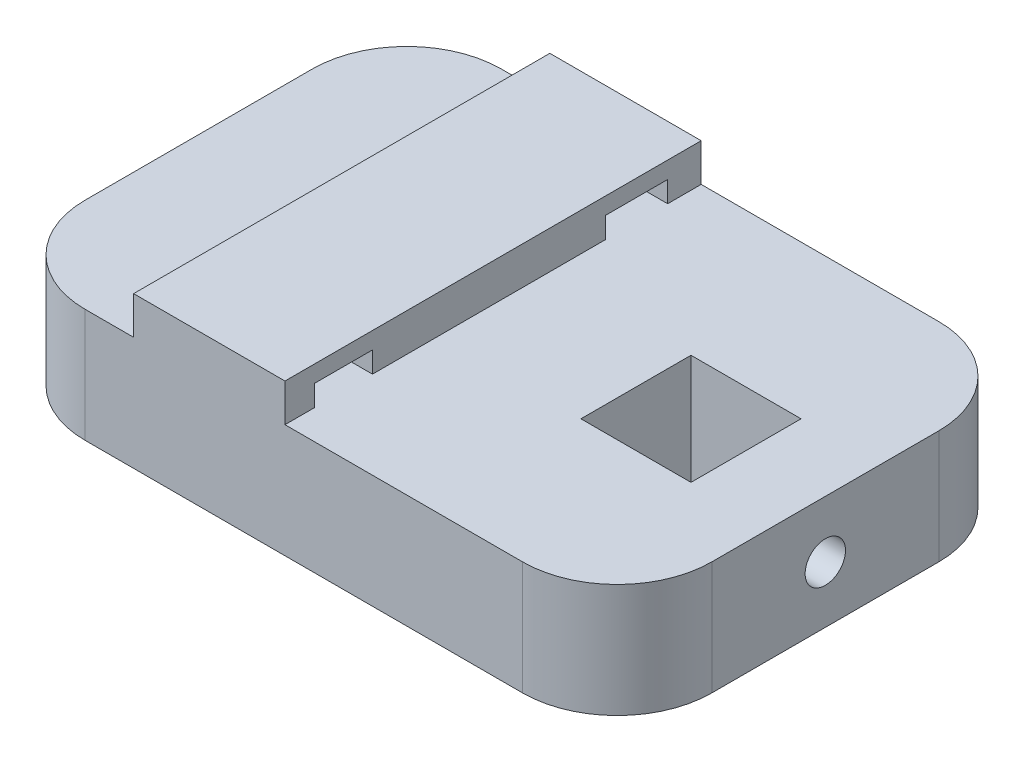
ISO-10303-21;
HEADER;
FILE_DESCRIPTION(('STEP AP214'),'2;1');
FILE_NAME('part.step','',(''),(''),'','','');
FILE_SCHEMA(('AUTOMOTIVE_DESIGN { 1 0 10303 214 1 1 1 1 }'));
ENDSEC;
DATA;
#1=APPLICATION_CONTEXT('core data for automotive mechanical design processes');
#2=APPLICATION_PROTOCOL_DEFINITION('international standard','automotive_design',2000,#1);
#3=PRODUCT_CONTEXT('',#1,'mechanical');
#4=PRODUCT('Part','Part','',(#3));
#5=PRODUCT_RELATED_PRODUCT_CATEGORY('part','',(#4));
#6=PRODUCT_DEFINITION_FORMATION('','',#4);
#7=PRODUCT_DEFINITION_CONTEXT('part definition',#1,'design');
#8=PRODUCT_DEFINITION('design','',#6,#7);
#9=PRODUCT_DEFINITION_SHAPE('','',#8);
#10=(LENGTH_UNIT() NAMED_UNIT(*) SI_UNIT(.MILLI.,.METRE.));
#11=(NAMED_UNIT(*) PLANE_ANGLE_UNIT() SI_UNIT($,.RADIAN.));
#12=(NAMED_UNIT(*) SI_UNIT($,.STERADIAN.) SOLID_ANGLE_UNIT());
#13=UNCERTAINTY_MEASURE_WITH_UNIT(LENGTH_MEASURE(1.E-05),#10,'distance_accuracy_value','');
#14=(GEOMETRIC_REPRESENTATION_CONTEXT(3) GLOBAL_UNCERTAINTY_ASSIGNED_CONTEXT((#13)) GLOBAL_UNIT_ASSIGNED_CONTEXT((#10,
#11,#12)) REPRESENTATION_CONTEXT('',''));
#15=CARTESIAN_POINT('',(0.,0.,0.));
#16=DIRECTION('',(0.,0.,1.));
#17=DIRECTION('',(1.,0.,0.));
#18=AXIS2_PLACEMENT_3D('',#15,#16,#17);
#19=CARTESIAN_POINT('',(41.400095641022,-10.0000000000002,55.));
#20=DIRECTION('',(-1.,0.,0.));
#21=DIRECTION('',(0.,0.,1.));
#22=AXIS2_PLACEMENT_3D('',#19,#20,#21);
#23=PLANE('',#22);
#24=CARTESIAN_POINT('',(41.400095641022,-2.51639275853466,27.5));
#25=DIRECTION('',(1.,0.,0.));
#26=DIRECTION('',(0.,0.,-1.));
#27=AXIS2_PLACEMENT_3D('',#24,#25,#26);
#28=CIRCLE('',#27,2.66597218164758);
#29=CARTESIAN_POINT('',(41.400095641022,-2.51639275853466,24.8340278183524));
#30=VERTEX_POINT('',#29);
#31=EDGE_CURVE('E257',#30,#30,#28,.T.);
#32=ORIENTED_EDGE('',*,*,#31,.F.);
#33=EDGE_LOOP('',(#32));
#34=FACE_BOUND('',#33,.T.);
#35=DIRECTION('',(0.,0.,-1.));
#36=VECTOR('',#35,1.);
#37=CARTESIAN_POINT('',(41.400095641022,-10.0000000000002,55.));
#38=LINE('',#37,#36);
#39=CARTESIAN_POINT('',(41.400095641022,-10.0000000000002,42.5));
#40=VERTEX_POINT('',#39);
#41=CARTESIAN_POINT('',(41.400095641022,-10.0000000000002,12.5));
#42=VERTEX_POINT('',#41);
#43=EDGE_CURVE('E289',#40,#42,#38,.T.);
#44=ORIENTED_EDGE('',*,*,#43,.T.);
#45=DIRECTION('',(0.,1.,0.));
#46=VECTOR('',#45,1.);
#47=CARTESIAN_POINT('',(41.400095641022,-10.0000000000002,12.5));
#48=LINE('',#47,#46);
#49=CARTESIAN_POINT('',(41.400095641022,5.00000000000021,12.5));
#50=VERTEX_POINT('',#49);
#51=EDGE_CURVE('E11',#42,#50,#48,.T.);
#52=ORIENTED_EDGE('',*,*,#51,.T.);
#53=DIRECTION('',(0.,0.,-1.));
#54=VECTOR('',#53,1.);
#55=CARTESIAN_POINT('',(41.400095641022,5.00000000000021,55.));
#56=LINE('',#55,#54);
#57=CARTESIAN_POINT('',(41.400095641022,5.00000000000021,42.5));
#58=VERTEX_POINT('',#57);
#59=EDGE_CURVE('E228',#58,#50,#56,.T.);
#60=ORIENTED_EDGE('',*,*,#59,.F.);
#61=DIRECTION('',(0.,1.,0.));
#62=VECTOR('',#61,1.);
#63=CARTESIAN_POINT('',(41.400095641022,-10.0000000000002,42.5));
#64=LINE('',#63,#62);
#65=EDGE_CURVE('E42',#58,#40,#64,.F.);
#66=ORIENTED_EDGE('',*,*,#65,.T.);
#67=EDGE_LOOP('',(#44,#52,#60,#66));
#68=FACE_BOUND('',#67,.T.);
#69=ADVANCED_FACE('F34',(#34,#68),#23,.F.);
#70=CARTESIAN_POINT('',(-2.49990516364096,5.00000000000021,55.));
#71=DIRECTION('',(-1.,0.,0.));
#72=DIRECTION('',(0.,0.,1.));
#73=AXIS2_PLACEMENT_3D('',#70,#71,#72);
#74=PLANE('',#73);
#75=DIRECTION('',(0.,0.,-1.));
#76=VECTOR('',#75,1.);
#77=CARTESIAN_POINT('',(-2.49990516364096,5.00000000000021,55.));
#78=LINE('',#77,#76);
#79=CARTESIAN_POINT('',(-2.49990516364096,5.00000000000021,55.));
#80=VERTEX_POINT('',#79);
#81=CARTESIAN_POINT('',(-2.49990516364096,5.00000000000021,51.1092158490829));
#82=VERTEX_POINT('',#81);
#83=EDGE_CURVE('E225',#80,#82,#78,.T.);
#84=ORIENTED_EDGE('',*,*,#83,.T.);
#85=DIRECTION('',(0.,-1.,0.));
#86=VECTOR('',#85,1.);
#87=CARTESIAN_POINT('',(-2.49990516364096,7.77710730648635,51.1092158490829));
#88=LINE('',#87,#86);
#89=CARTESIAN_POINT('',(-2.49990516364096,7.77710730648635,51.1092158490829));
#90=VERTEX_POINT('',#89);
#91=EDGE_CURVE('E220',#90,#82,#88,.T.);
#92=ORIENTED_EDGE('',*,*,#91,.F.);
#93=DIRECTION('',(0.,0.,1.));
#94=VECTOR('',#93,1.);
#95=CARTESIAN_POINT('',(-2.49990516364096,7.77710730648635,51.1092158490829));
#96=LINE('',#95,#94);
#97=CARTESIAN_POINT('',(-2.49990516364096,7.77710730648635,43.4359727984542));
#98=VERTEX_POINT('',#97);
#99=EDGE_CURVE('E219',#98,#90,#96,.T.);
#100=ORIENTED_EDGE('',*,*,#99,.F.);
#101=DIRECTION('',(0.,1.,0.));
#102=VECTOR('',#101,1.);
#103=CARTESIAN_POINT('',(-2.49990516364096,7.77710730648635,43.4359727984542));
#104=LINE('',#103,#102);
#105=CARTESIAN_POINT('',(-2.49990516364096,5.00000000000021,43.4359727984542));
#106=VERTEX_POINT('',#105);
#107=EDGE_CURVE('E200',#106,#98,#104,.T.);
#108=ORIENTED_EDGE('',*,*,#107,.F.);
#109=CARTESIAN_POINT('',(-2.49990516364096,5.00000000000021,12.6151132117625));
#110=VERTEX_POINT('',#109);
#111=EDGE_CURVE('E216',#106,#110,#78,.T.);
#112=ORIENTED_EDGE('',*,*,#111,.T.);
#113=DIRECTION('',(0.,-1.,0.));
#114=VECTOR('',#113,1.);
#115=CARTESIAN_POINT('',(-2.49990516364096,7.77710730648635,12.6151132117625));
#116=LINE('',#115,#114);
#117=CARTESIAN_POINT('',(-2.49990516364096,7.77710730648635,12.6151132117625));
#118=VERTEX_POINT('',#117);
#119=EDGE_CURVE('E256',#118,#110,#116,.T.);
#120=ORIENTED_EDGE('',*,*,#119,.F.);
#121=DIRECTION('',(0.,0.,1.));
#122=VECTOR('',#121,1.);
#123=CARTESIAN_POINT('',(-2.49990516364096,7.77710730648635,12.6151132117625));
#124=LINE('',#123,#122);
#125=CARTESIAN_POINT('',(-2.49990516364096,7.77710730648635,4.43032062442529));
#126=VERTEX_POINT('',#125);
#127=EDGE_CURVE('E478',#126,#118,#124,.T.);
#128=ORIENTED_EDGE('',*,*,#127,.F.);
#129=DIRECTION('',(0.,1.,0.));
#130=VECTOR('',#129,1.);
#131=CARTESIAN_POINT('',(-2.49990516364096,7.77710730648635,4.43032062442529));
#132=LINE('',#131,#130);
#133=CARTESIAN_POINT('',(-2.49990516364096,5.00000000000021,4.43032062442529));
#134=VERTEX_POINT('',#133);
#135=EDGE_CURVE('E475',#134,#126,#132,.T.);
#136=ORIENTED_EDGE('',*,*,#135,.F.);
#137=CARTESIAN_POINT('',(-2.49990516364096,5.00000000000021,0.));
#138=VERTEX_POINT('',#137);
#139=EDGE_CURVE('E226',#134,#138,#78,.T.);
#140=ORIENTED_EDGE('',*,*,#139,.T.);
#141=DIRECTION('',(0.,1.,0.));
#142=VECTOR('',#141,1.);
#143=CARTESIAN_POINT('',(-2.49990516364096,5.00000000000021,0.));
#144=LINE('',#143,#142);
#145=CARTESIAN_POINT('',(-2.49990516364096,10.0000000000002,0.));
#146=VERTEX_POINT('',#145);
#147=EDGE_CURVE('E331',#138,#146,#144,.T.);
#148=ORIENTED_EDGE('',*,*,#147,.T.);
#149=DIRECTION('',(0.,0.,-1.));
#150=VECTOR('',#149,1.);
#151=CARTESIAN_POINT('',(-2.49990516364096,10.0000000000002,55.));
#152=LINE('',#151,#150);
#153=CARTESIAN_POINT('',(-2.49990516364096,10.0000000000002,55.));
#154=VERTEX_POINT('',#153);
#155=EDGE_CURVE('E230',#154,#146,#152,.T.);
#156=ORIENTED_EDGE('',*,*,#155,.F.);
#157=DIRECTION('',(0.,1.,0.));
#158=VECTOR('',#157,1.);
#159=CARTESIAN_POINT('',(-2.49990516364096,5.00000000000021,55.));
#160=LINE('',#159,#158);
#161=EDGE_CURVE('E312',#80,#154,#160,.T.);
#162=ORIENTED_EDGE('',*,*,#161,.F.);
#163=EDGE_LOOP('',(#84,#92,#100,#108,#112,#120,#128,#136,#140,#148,#156,#162));
#164=FACE_BOUND('',#163,.T.);
#165=ADVANCED_FACE('F214',(#164),#74,.F.);
#166=CARTESIAN_POINT('',(-2.49990516364096,10.0000000000002,55.));
#167=DIRECTION('',(0.,-1.,0.));
#168=DIRECTION('',(0.,0.,-1.));
#169=AXIS2_PLACEMENT_3D('',#166,#167,#168);
#170=PLANE('',#169);
#171=DIRECTION('',(-1.,0.,0.));
#172=VECTOR('',#171,1.);
#173=CARTESIAN_POINT('',(-2.49990516364096,10.0000000000002,0.));
#174=LINE('',#173,#172);
#175=CARTESIAN_POINT('',(-22.499903554315,10.0000000000002,0.));
#176=VERTEX_POINT('',#175);
#177=EDGE_CURVE('E334',#146,#176,#174,.T.);
#178=ORIENTED_EDGE('',*,*,#177,.T.);
#179=DIRECTION('',(0.,0.,-1.));
#180=VECTOR('',#179,1.);
#181=CARTESIAN_POINT('',(-22.499903554315,10.0000000000002,55.));
#182=LINE('',#181,#180);
#183=CARTESIAN_POINT('',(-22.499903554315,10.0000000000002,55.));
#184=VERTEX_POINT('',#183);
#185=EDGE_CURVE('E347',#184,#176,#182,.T.);
#186=ORIENTED_EDGE('',*,*,#185,.F.);
#187=DIRECTION('',(-1.,0.,0.));
#188=VECTOR('',#187,1.);
#189=CARTESIAN_POINT('',(-2.49990516364096,10.0000000000002,55.));
#190=LINE('',#189,#188);
#191=EDGE_CURVE('E315',#154,#184,#190,.T.);
#192=ORIENTED_EDGE('',*,*,#191,.F.);
#193=ORIENTED_EDGE('',*,*,#155,.T.);
#194=EDGE_LOOP('',(#178,#186,#192,#193));
#195=FACE_BOUND('',#194,.T.);
#196=ADVANCED_FACE('F359',(#195),#170,.F.);
#197=CARTESIAN_POINT('',(-22.499903554315,10.0000000000002,55.));
#198=DIRECTION('',(1.,0.,0.));
#199=DIRECTION('',(0.,0.,-1.));
#200=AXIS2_PLACEMENT_3D('',#197,#198,#199);
#201=PLANE('',#200);
#202=DIRECTION('',(0.,0.,1.));
#203=VECTOR('',#202,1.);
#204=CARTESIAN_POINT('',(-22.499903554315,7.77710730648635,55.));
#205=LINE('',#204,#203);
#206=CARTESIAN_POINT('',(-22.499903554315,7.77710730648635,43.4359727984542));
#207=VERTEX_POINT('',#206);
#208=CARTESIAN_POINT('',(-22.499903554315,7.77710730648635,51.1092158490829));
#209=VERTEX_POINT('',#208);
#210=EDGE_CURVE('E249',#207,#209,#205,.T.);
#211=ORIENTED_EDGE('',*,*,#210,.T.);
#212=DIRECTION('',(0.,-1.,0.));
#213=VECTOR('',#212,1.);
#214=CARTESIAN_POINT('',(-22.499903554315,10.0000000000002,51.1092158490829));
#215=LINE('',#214,#213);
#216=CARTESIAN_POINT('',(-22.499903554315,5.00000000000021,51.1092158490829));
#217=VERTEX_POINT('',#216);
#218=EDGE_CURVE('E376',#209,#217,#215,.T.);
#219=ORIENTED_EDGE('',*,*,#218,.T.);
#220=DIRECTION('',(0.,0.,-1.));
#221=VECTOR('',#220,1.);
#222=CARTESIAN_POINT('',(-22.499903554315,5.00000000000021,55.));
#223=LINE('',#222,#221);
#224=CARTESIAN_POINT('',(-22.499903554315,5.00000000000021,55.));
#225=VERTEX_POINT('',#224);
#226=EDGE_CURVE('E345',#225,#217,#223,.T.);
#227=ORIENTED_EDGE('',*,*,#226,.F.);
#228=DIRECTION('',(0.,-1.,0.));
#229=VECTOR('',#228,1.);
#230=CARTESIAN_POINT('',(-22.499903554315,10.0000000000002,55.));
#231=LINE('',#230,#229);
#232=EDGE_CURVE('E324',#184,#225,#231,.T.);
#233=ORIENTED_EDGE('',*,*,#232,.F.);
#234=ORIENTED_EDGE('',*,*,#185,.T.);
#235=DIRECTION('',(0.,-1.,0.));
#236=VECTOR('',#235,1.);
#237=CARTESIAN_POINT('',(-22.499903554315,10.0000000000002,0.));
#238=LINE('',#237,#236);
#239=CARTESIAN_POINT('',(-22.499903554315,5.00000000000021,0.));
#240=VERTEX_POINT('',#239);
#241=EDGE_CURVE('E336',#176,#240,#238,.T.);
#242=ORIENTED_EDGE('',*,*,#241,.T.);
#243=CARTESIAN_POINT('',(-22.499903554315,5.00000000000021,4.43032062442529));
#244=VERTEX_POINT('',#243);
#245=EDGE_CURVE('E344',#244,#240,#223,.T.);
#246=ORIENTED_EDGE('',*,*,#245,.F.);
#247=DIRECTION('',(0.,1.,0.));
#248=VECTOR('',#247,1.);
#249=CARTESIAN_POINT('',(-22.499903554315,10.0000000000002,4.43032062442529));
#250=LINE('',#249,#248);
#251=CARTESIAN_POINT('',(-22.499903554315,7.77710730648635,4.43032062442529));
#252=VERTEX_POINT('',#251);
#253=EDGE_CURVE('E370',#244,#252,#250,.T.);
#254=ORIENTED_EDGE('',*,*,#253,.T.);
#255=DIRECTION('',(0.,0.,1.));
#256=VECTOR('',#255,1.);
#257=CARTESIAN_POINT('',(-22.499903554315,7.77710730648635,55.));
#258=LINE('',#257,#256);
#259=CARTESIAN_POINT('',(-22.499903554315,7.77710730648635,12.6151132117625));
#260=VERTEX_POINT('',#259);
#261=EDGE_CURVE('E246',#252,#260,#258,.T.);
#262=ORIENTED_EDGE('',*,*,#261,.T.);
#263=DIRECTION('',(0.,-1.,0.));
#264=VECTOR('',#263,1.);
#265=CARTESIAN_POINT('',(-22.499903554315,10.0000000000002,12.6151132117625));
#266=LINE('',#265,#264);
#267=CARTESIAN_POINT('',(-22.499903554315,5.00000000000021,12.6151132117625));
#268=VERTEX_POINT('',#267);
#269=EDGE_CURVE('E372',#260,#268,#266,.T.);
#270=ORIENTED_EDGE('',*,*,#269,.T.);
#271=CARTESIAN_POINT('',(-22.499903554315,5.00000000000021,43.4359727984542));
#272=VERTEX_POINT('',#271);
#273=EDGE_CURVE('E348',#272,#268,#223,.T.);
#274=ORIENTED_EDGE('',*,*,#273,.F.);
#275=DIRECTION('',(0.,1.,0.));
#276=VECTOR('',#275,1.);
#277=CARTESIAN_POINT('',(-22.499903554315,10.0000000000002,43.4359727984542));
#278=LINE('',#277,#276);
#279=EDGE_CURVE('E203',#272,#207,#278,.T.);
#280=ORIENTED_EDGE('',*,*,#279,.T.);
#281=EDGE_LOOP('',(#211,#219,#227,#233,#234,#242,#246,#254,#262,#270,#274,#280));
#282=FACE_BOUND('',#281,.T.);
#283=ADVANCED_FACE('F367',(#282),#201,.F.);
#284=CARTESIAN_POINT('',(-28.9000956410219,5.00000000000021,55.));
#285=DIRECTION('',(0.,-1.,0.));
#286=DIRECTION('',(0.,0.,-1.));
#287=AXIS2_PLACEMENT_3D('',#284,#285,#286);
#288=PLANE('',#287);
#289=ORIENTED_EDGE('',*,*,#111,.F.);
#290=DIRECTION('',(1.,0.,0.));
#291=VECTOR('',#290,1.);
#292=CARTESIAN_POINT('',(-57.499905163641,5.00000000000021,43.4359727984542));
#293=LINE('',#292,#291);
#294=EDGE_CURVE('E196',#272,#106,#293,.T.);
#295=ORIENTED_EDGE('',*,*,#294,.F.);
#296=ORIENTED_EDGE('',*,*,#273,.T.);
#297=DIRECTION('',(1.,0.,0.));
#298=VECTOR('',#297,1.);
#299=CARTESIAN_POINT('',(-57.499905163641,5.00000000000021,12.6151132117625));
#300=LINE('',#299,#298);
#301=EDGE_CURVE('E224',#268,#110,#300,.T.);
#302=ORIENTED_EDGE('',*,*,#301,.T.);
#303=EDGE_LOOP('',(#289,#295,#296,#302));
#304=FACE_BOUND('',#303,.T.);
#305=DIRECTION('',(-1.,0.,0.));
#306=VECTOR('',#305,1.);
#307=CARTESIAN_POINT('',(-28.9000956410219,5.00000000000021,0.));
#308=LINE('',#307,#306);
#309=CARTESIAN_POINT('',(-28.9000956410221,5.00000000000021,0.));
#310=VERTEX_POINT('',#309);
#311=EDGE_CURVE('E317',#240,#310,#308,.T.);
#312=ORIENTED_EDGE('',*,*,#311,.T.);
#313=CARTESIAN_POINT('',(-28.9000956410221,5.00000000000021,12.5));
#314=DIRECTION('',(0.,-1.,0.));
#315=DIRECTION('',(0.,0.,-1.));
#316=AXIS2_PLACEMENT_3D('',#313,#314,#315);
#317=CIRCLE('',#316,12.5);
#318=CARTESIAN_POINT('',(-41.4000956410221,5.00000000000021,12.5));
#319=VERTEX_POINT('',#318);
#320=EDGE_CURVE('E278',#310,#319,#317,.F.);
#321=ORIENTED_EDGE('',*,*,#320,.T.);
#322=DIRECTION('',(0.,0.,-1.));
#323=VECTOR('',#322,1.);
#324=CARTESIAN_POINT('',(-41.4000956410221,5.00000000000021,55.));
#325=LINE('',#324,#323);
#326=CARTESIAN_POINT('',(-41.4000956410221,5.00000000000021,42.5));
#327=VERTEX_POINT('',#326);
#328=EDGE_CURVE('E341',#327,#319,#325,.T.);
#329=ORIENTED_EDGE('',*,*,#328,.F.);
#330=CARTESIAN_POINT('',(-28.9000956410221,5.00000000000021,42.5));
#331=DIRECTION('',(0.,-1.,0.));
#332=DIRECTION('',(0.,0.,-1.));
#333=AXIS2_PLACEMENT_3D('',#330,#331,#332);
#334=CIRCLE('',#333,12.5);
#335=CARTESIAN_POINT('',(-28.9000956410221,5.00000000000021,55.));
#336=VERTEX_POINT('',#335);
#337=EDGE_CURVE('E276',#327,#336,#334,.F.);
#338=ORIENTED_EDGE('',*,*,#337,.T.);
#339=DIRECTION('',(-1.,0.,0.));
#340=VECTOR('',#339,1.);
#341=CARTESIAN_POINT('',(-22.499903554315,5.00000000000021,55.));
#342=LINE('',#341,#340);
#343=EDGE_CURVE('E326',#225,#336,#342,.T.);
#344=ORIENTED_EDGE('',*,*,#343,.F.);
#345=ORIENTED_EDGE('',*,*,#226,.T.);
#346=DIRECTION('',(1.,0.,0.));
#347=VECTOR('',#346,1.);
#348=CARTESIAN_POINT('',(-57.499905163641,5.00000000000021,51.1092158490829));
#349=LINE('',#348,#347);
#350=EDGE_CURVE('E209',#217,#82,#349,.T.);
#351=ORIENTED_EDGE('',*,*,#350,.T.);
#352=ORIENTED_EDGE('',*,*,#83,.F.);
#353=DIRECTION('',(-1.,0.,0.));
#354=VECTOR('',#353,1.);
#355=CARTESIAN_POINT('',(41.400095641022,5.00000000000021,55.));
#356=LINE('',#355,#354);
#357=CARTESIAN_POINT('',(28.900095641022,5.00000000000021,55.));
#358=VERTEX_POINT('',#357);
#359=EDGE_CURVE('E306',#358,#80,#356,.T.);
#360=ORIENTED_EDGE('',*,*,#359,.F.);
#361=CARTESIAN_POINT('',(28.900095641022,5.00000000000021,42.5));
#362=DIRECTION('',(0.,-1.,0.));
#363=DIRECTION('',(0.,0.,-1.));
#364=AXIS2_PLACEMENT_3D('',#361,#362,#363);
#365=CIRCLE('',#364,12.5);
#366=EDGE_CURVE('E56',#358,#58,#365,.F.);
#367=ORIENTED_EDGE('',*,*,#366,.T.);
#368=ORIENTED_EDGE('',*,*,#59,.T.);
#369=CARTESIAN_POINT('',(28.900095641022,5.00000000000021,12.5));
#370=DIRECTION('',(0.,-1.,0.));
#371=DIRECTION('',(0.,0.,-1.));
#372=AXIS2_PLACEMENT_3D('',#369,#370,#371);
#373=CIRCLE('',#372,12.5);
#374=CARTESIAN_POINT('',(28.900095641022,5.00000000000021,0.));
#375=VERTEX_POINT('',#374);
#376=EDGE_CURVE('E49',#50,#375,#373,.F.);
#377=ORIENTED_EDGE('',*,*,#376,.T.);
#378=DIRECTION('',(-1.,0.,0.));
#379=VECTOR('',#378,1.);
#380=CARTESIAN_POINT('',(28.900095641022,5.00000000000021,0.));
#381=LINE('',#380,#379);
#382=EDGE_CURVE('E329',#375,#138,#381,.T.);
#383=ORIENTED_EDGE('',*,*,#382,.T.);
#384=ORIENTED_EDGE('',*,*,#139,.F.);
#385=DIRECTION('',(1.,0.,0.));
#386=VECTOR('',#385,1.);
#387=CARTESIAN_POINT('',(-57.499905163641,5.00000000000021,4.43032062442529));
#388=LINE('',#387,#386);
#389=EDGE_CURVE('E485',#244,#134,#388,.T.);
#390=ORIENTED_EDGE('',*,*,#389,.F.);
#391=ORIENTED_EDGE('',*,*,#245,.T.);
#392=EDGE_LOOP('',(#312,#321,#329,#338,#344,#345,#351,#352,#360,#367,#368,#377,#383,#384,#390,#391));
#393=FACE_BOUND('',#392,.T.);
#394=DIRECTION('',(0.,0.,1.));
#395=VECTOR('',#394,1.);
#396=CARTESIAN_POINT('',(16.3790224203838,5.00000000000021,0.));
#397=LINE('',#396,#395);
#398=CARTESIAN_POINT('',(16.3790224203838,5.00000000000021,20.2274188307999));
#399=VERTEX_POINT('',#398);
#400=CARTESIAN_POINT('',(16.3790224203838,5.00000000000021,34.7725811692001));
#401=VERTEX_POINT('',#400);
#402=EDGE_CURVE('E386',#399,#401,#397,.T.);
#403=ORIENTED_EDGE('',*,*,#402,.F.);
#404=DIRECTION('',(-1.,0.,0.));
#405=VECTOR('',#404,1.);
#406=CARTESIAN_POINT('',(0.,5.00000000000021,20.2274188307999));
#407=LINE('',#406,#405);
#408=CARTESIAN_POINT('',(30.924184758784,5.00000000000021,20.2274188307999));
#409=VERTEX_POINT('',#408);
#410=EDGE_CURVE('E384',#409,#399,#407,.T.);
#411=ORIENTED_EDGE('',*,*,#410,.F.);
#412=DIRECTION('',(0.,0.,1.));
#413=VECTOR('',#412,1.);
#414=CARTESIAN_POINT('',(30.924184758784,5.00000000000021,0.));
#415=LINE('',#414,#413);
#416=CARTESIAN_POINT('',(30.924184758784,5.00000000000021,34.7725811692001));
#417=VERTEX_POINT('',#416);
#418=EDGE_CURVE('E392',#409,#417,#415,.T.);
#419=ORIENTED_EDGE('',*,*,#418,.T.);
#420=DIRECTION('',(-1.,0.,0.));
#421=VECTOR('',#420,1.);
#422=CARTESIAN_POINT('',(0.,5.00000000000021,34.7725811692001));
#423=LINE('',#422,#421);
#424=EDGE_CURVE('E389',#417,#401,#423,.T.);
#425=ORIENTED_EDGE('',*,*,#424,.T.);
#426=EDGE_LOOP('',(#403,#411,#419,#425));
#427=FACE_BOUND('',#426,.T.);
#428=ADVANCED_FACE('F223',(#304,#393,#427),#288,.F.);
#429=CARTESIAN_POINT('',(-41.4000956410221,5.00000000000021,55.));
#430=DIRECTION('',(1.,0.,0.));
#431=DIRECTION('',(0.,0.,-1.));
#432=AXIS2_PLACEMENT_3D('',#429,#430,#431);
#433=PLANE('',#432);
#434=ORIENTED_EDGE('',*,*,#328,.T.);
#435=DIRECTION('',(0.,-1.,0.));
#436=VECTOR('',#435,1.);
#437=CARTESIAN_POINT('',(-41.4000956410221,5.00000000000021,12.5));
#438=LINE('',#437,#436);
#439=CARTESIAN_POINT('',(-41.4000956410221,-10.0000000000002,12.5));
#440=VERTEX_POINT('',#439);
#441=EDGE_CURVE('E259',#319,#440,#438,.T.);
#442=ORIENTED_EDGE('',*,*,#441,.T.);
#443=DIRECTION('',(0.,0.,-1.));
#444=VECTOR('',#443,1.);
#445=CARTESIAN_POINT('',(-41.4000956410221,-10.0000000000002,55.));
#446=LINE('',#445,#444);
#447=CARTESIAN_POINT('',(-41.4000956410221,-10.0000000000002,42.5));
#448=VERTEX_POINT('',#447);
#449=EDGE_CURVE('E299',#448,#440,#446,.T.);
#450=ORIENTED_EDGE('',*,*,#449,.F.);
#451=DIRECTION('',(0.,-1.,0.));
#452=VECTOR('',#451,1.);
#453=CARTESIAN_POINT('',(-41.4000956410221,5.00000000000021,42.5));
#454=LINE('',#453,#452);
#455=EDGE_CURVE('E252',#448,#327,#454,.F.);
#456=ORIENTED_EDGE('',*,*,#455,.T.);
#457=EDGE_LOOP('',(#434,#442,#450,#456));
#458=FACE_BOUND('',#457,.T.);
#459=ADVANCED_FACE('F457',(#458),#433,.F.);
#460=CARTESIAN_POINT('',(28.900095641022,-10.0000000000002,55.));
#461=DIRECTION('',(0.,1.,0.));
#462=DIRECTION('',(0.,0.,1.));
#463=AXIS2_PLACEMENT_3D('',#460,#461,#462);
#464=PLANE('',#463);
#465=DIRECTION('',(0.,0.,1.));
#466=VECTOR('',#465,1.);
#467=CARTESIAN_POINT('',(30.924184758784,-10.0000000000002,55.));
#468=LINE('',#467,#466);
#469=CARTESIAN_POINT('',(30.924184758784,-10.0000000000002,20.2274188307999));
#470=VERTEX_POINT('',#469);
#471=CARTESIAN_POINT('',(30.924184758784,-10.0000000000002,34.7725811692001));
#472=VERTEX_POINT('',#471);
#473=EDGE_CURVE('E241',#470,#472,#468,.T.);
#474=ORIENTED_EDGE('',*,*,#473,.F.);
#475=DIRECTION('',(-1.,0.,0.));
#476=VECTOR('',#475,1.);
#477=CARTESIAN_POINT('',(28.900095641022,-10.0000000000002,20.2274188307999));
#478=LINE('',#477,#476);
#479=CARTESIAN_POINT('',(16.3790224203838,-10.0000000000002,20.2274188307999));
#480=VERTEX_POINT('',#479);
#481=EDGE_CURVE('E243',#470,#480,#478,.T.);
#482=ORIENTED_EDGE('',*,*,#481,.T.);
#483=DIRECTION('',(0.,0.,1.));
#484=VECTOR('',#483,1.);
#485=CARTESIAN_POINT('',(16.3790224203838,-10.0000000000002,55.));
#486=LINE('',#485,#484);
#487=CARTESIAN_POINT('',(16.3790224203838,-10.0000000000002,34.7725811692001));
#488=VERTEX_POINT('',#487);
#489=EDGE_CURVE('E235',#480,#488,#486,.T.);
#490=ORIENTED_EDGE('',*,*,#489,.T.);
#491=DIRECTION('',(-1.,0.,0.));
#492=VECTOR('',#491,1.);
#493=CARTESIAN_POINT('',(28.900095641022,-10.0000000000002,34.7725811692001));
#494=LINE('',#493,#492);
#495=EDGE_CURVE('E238',#472,#488,#494,.T.);
#496=ORIENTED_EDGE('',*,*,#495,.F.);
#497=EDGE_LOOP('',(#474,#482,#490,#496));
#498=FACE_BOUND('',#497,.T.);
#499=ORIENTED_EDGE('',*,*,#449,.T.);
#500=CARTESIAN_POINT('',(-28.9000956410221,-10.0000000000002,12.5));
#501=DIRECTION('',(0.,1.,0.));
#502=DIRECTION('',(0.,0.,1.));
#503=AXIS2_PLACEMENT_3D('',#500,#501,#502);
#504=CIRCLE('',#503,12.5);
#505=CARTESIAN_POINT('',(-28.9000956410221,-10.0000000000002,0.));
#506=VERTEX_POINT('',#505);
#507=EDGE_CURVE('E268',#440,#506,#504,.F.);
#508=ORIENTED_EDGE('',*,*,#507,.T.);
#509=DIRECTION('',(1.,0.,0.));
#510=VECTOR('',#509,1.);
#511=CARTESIAN_POINT('',(28.900095641022,-10.0000000000002,0.));
#512=LINE('',#511,#510);
#513=CARTESIAN_POINT('',(28.900095641022,-10.0000000000002,0.));
#514=VERTEX_POINT('',#513);
#515=EDGE_CURVE('E313',#506,#514,#512,.T.);
#516=ORIENTED_EDGE('',*,*,#515,.T.);
#517=CARTESIAN_POINT('',(28.900095641022,-10.0000000000002,12.5));
#518=DIRECTION('',(0.,1.,0.));
#519=DIRECTION('',(0.,0.,1.));
#520=AXIS2_PLACEMENT_3D('',#517,#518,#519);
#521=CIRCLE('',#520,12.5);
#522=EDGE_CURVE('E264',#514,#42,#521,.F.);
#523=ORIENTED_EDGE('',*,*,#522,.T.);
#524=ORIENTED_EDGE('',*,*,#43,.F.);
#525=CARTESIAN_POINT('',(28.900095641022,-10.0000000000002,42.5));
#526=DIRECTION('',(0.,1.,0.));
#527=DIRECTION('',(0.,0.,1.));
#528=AXIS2_PLACEMENT_3D('',#525,#526,#527);
#529=CIRCLE('',#528,12.5);
#530=CARTESIAN_POINT('',(28.900095641022,-10.0000000000002,55.));
#531=VERTEX_POINT('',#530);
#532=EDGE_CURVE('E262',#40,#531,#529,.F.);
#533=ORIENTED_EDGE('',*,*,#532,.T.);
#534=DIRECTION('',(1.,0.,0.));
#535=VECTOR('',#534,1.);
#536=CARTESIAN_POINT('',(-41.4000956410221,-10.0000000000002,55.));
#537=LINE('',#536,#535);
#538=CARTESIAN_POINT('',(-28.9000956410221,-10.0000000000002,55.));
#539=VERTEX_POINT('',#538);
#540=EDGE_CURVE('E300',#539,#531,#537,.T.);
#541=ORIENTED_EDGE('',*,*,#540,.F.);
#542=CARTESIAN_POINT('',(-28.9000956410221,-10.0000000000002,42.5));
#543=DIRECTION('',(0.,1.,0.));
#544=DIRECTION('',(0.,0.,1.));
#545=AXIS2_PLACEMENT_3D('',#542,#543,#544);
#546=CIRCLE('',#545,12.5);
#547=EDGE_CURVE('E266',#539,#448,#546,.F.);
#548=ORIENTED_EDGE('',*,*,#547,.T.);
#549=EDGE_LOOP('',(#499,#508,#516,#523,#524,#533,#541,#548));
#550=FACE_BOUND('',#549,.T.);
#551=ADVANCED_FACE('F294',(#498,#550),#464,.F.);
#552=CARTESIAN_POINT('',(0.,0.,55.));
#553=DIRECTION('',(0.,0.,1.));
#554=DIRECTION('',(1.,0.,0.));
#555=AXIS2_PLACEMENT_3D('',#552,#553,#554);
#556=PLANE('',#555);
#557=ORIENTED_EDGE('',*,*,#343,.T.);
#558=DIRECTION('',(0.,-1.,0.));
#559=VECTOR('',#558,1.);
#560=CARTESIAN_POINT('',(-28.9000956410221,-10.0000000000002,55.));
#561=LINE('',#560,#559);
#562=EDGE_CURVE('E283',#336,#539,#561,.T.);
#563=ORIENTED_EDGE('',*,*,#562,.T.);
#564=ORIENTED_EDGE('',*,*,#540,.T.);
#565=DIRECTION('',(0.,1.,0.));
#566=VECTOR('',#565,1.);
#567=CARTESIAN_POINT('',(28.900095641022,5.00000000000021,55.));
#568=LINE('',#567,#566);
#569=EDGE_CURVE('E280',#531,#358,#568,.T.);
#570=ORIENTED_EDGE('',*,*,#569,.T.);
#571=ORIENTED_EDGE('',*,*,#359,.T.);
#572=ORIENTED_EDGE('',*,*,#161,.T.);
#573=ORIENTED_EDGE('',*,*,#191,.T.);
#574=ORIENTED_EDGE('',*,*,#232,.T.);
#575=EDGE_LOOP('',(#557,#563,#564,#570,#571,#572,#573,#574));
#576=FACE_BOUND('',#575,.T.);
#577=ADVANCED_FACE('F305',(#576),#556,.T.);
#578=CARTESIAN_POINT('',(0.,0.,0.));
#579=DIRECTION('',(0.,0.,1.));
#580=DIRECTION('',(1.,0.,0.));
#581=AXIS2_PLACEMENT_3D('',#578,#579,#580);
#582=PLANE('',#581);
#583=ORIENTED_EDGE('',*,*,#515,.F.);
#584=DIRECTION('',(0.,-1.,0.));
#585=VECTOR('',#584,1.);
#586=CARTESIAN_POINT('',(-28.9000956410221,0.,0.));
#587=LINE('',#586,#585);
#588=EDGE_CURVE('E272',#506,#310,#587,.F.);
#589=ORIENTED_EDGE('',*,*,#588,.T.);
#590=ORIENTED_EDGE('',*,*,#311,.F.);
#591=ORIENTED_EDGE('',*,*,#241,.F.);
#592=ORIENTED_EDGE('',*,*,#177,.F.);
#593=ORIENTED_EDGE('',*,*,#147,.F.);
#594=ORIENTED_EDGE('',*,*,#382,.F.);
#595=DIRECTION('',(0.,1.,0.));
#596=VECTOR('',#595,1.);
#597=CARTESIAN_POINT('',(28.900095641022,0.,0.));
#598=LINE('',#597,#596);
#599=EDGE_CURVE('E270',#375,#514,#598,.F.);
#600=ORIENTED_EDGE('',*,*,#599,.T.);
#601=EDGE_LOOP('',(#583,#589,#590,#591,#592,#593,#594,#600));
#602=FACE_BOUND('',#601,.T.);
#603=ADVANCED_FACE('F363',(#602),#582,.F.);
#604=CARTESIAN_POINT('',(0.,-49.9999999999998,20.2274188307999));
#605=DIRECTION('',(0.,0.,-1.));
#606=DIRECTION('',(-1.,0.,0.));
#607=AXIS2_PLACEMENT_3D('',#604,#605,#606);
#608=PLANE('',#607);
#609=DIRECTION('',(0.,1.,0.));
#610=VECTOR('',#609,1.);
#611=CARTESIAN_POINT('',(30.924184758784,-49.9999999999998,20.2274188307999));
#612=LINE('',#611,#610);
#613=EDGE_CURVE('E332',#470,#409,#612,.T.);
#614=ORIENTED_EDGE('',*,*,#613,.T.);
#615=ORIENTED_EDGE('',*,*,#410,.T.);
#616=DIRECTION('',(0.,1.,0.));
#617=VECTOR('',#616,1.);
#618=CARTESIAN_POINT('',(16.3790224203838,-49.9999999999998,20.2274188307999));
#619=LINE('',#618,#617);
#620=EDGE_CURVE('E320',#480,#399,#619,.T.);
#621=ORIENTED_EDGE('',*,*,#620,.F.);
#622=ORIENTED_EDGE('',*,*,#481,.F.);
#623=EDGE_LOOP('',(#614,#615,#621,#622));
#624=FACE_BOUND('',#623,.T.);
#625=ADVANCED_FACE('F415',(#624),#608,.F.);
#626=CARTESIAN_POINT('',(30.924184758784,-49.9999999999998,0.));
#627=DIRECTION('',(-1.,0.,0.));
#628=DIRECTION('',(0.,0.,1.));
#629=AXIS2_PLACEMENT_3D('',#626,#627,#628);
#630=PLANE('',#629);
#631=CARTESIAN_POINT('',(30.924184758784,-2.51639275853466,27.5));
#632=DIRECTION('',(-1.,0.,0.));
#633=DIRECTION('',(0.,0.,1.));
#634=AXIS2_PLACEMENT_3D('',#631,#632,#633);
#635=CIRCLE('',#634,2.66597218164758);
#636=CARTESIAN_POINT('',(30.924184758784,-2.51639275853466,30.1659721816476));
#637=VERTEX_POINT('',#636);
#638=EDGE_CURVE('E253',#637,#637,#635,.T.);
#639=ORIENTED_EDGE('',*,*,#638,.F.);
#640=EDGE_LOOP('',(#639));
#641=FACE_BOUND('',#640,.T.);
#642=ORIENTED_EDGE('',*,*,#473,.T.);
#643=DIRECTION('',(0.,1.,0.));
#644=VECTOR('',#643,1.);
#645=CARTESIAN_POINT('',(30.924184758784,-49.9999999999998,34.7725811692001));
#646=LINE('',#645,#644);
#647=EDGE_CURVE('E396',#472,#417,#646,.T.);
#648=ORIENTED_EDGE('',*,*,#647,.T.);
#649=ORIENTED_EDGE('',*,*,#418,.F.);
#650=ORIENTED_EDGE('',*,*,#613,.F.);
#651=EDGE_LOOP('',(#642,#648,#649,#650));
#652=FACE_BOUND('',#651,.T.);
#653=ADVANCED_FACE('F416',(#641,#652),#630,.T.);
#654=CARTESIAN_POINT('',(0.,-49.9999999999998,34.7725811692001));
#655=DIRECTION('',(0.,0.,-1.));
#656=DIRECTION('',(-1.,0.,0.));
#657=AXIS2_PLACEMENT_3D('',#654,#655,#656);
#658=PLANE('',#657);
#659=ORIENTED_EDGE('',*,*,#495,.T.);
#660=DIRECTION('',(0.,1.,0.));
#661=VECTOR('',#660,1.);
#662=CARTESIAN_POINT('',(16.3790224203838,-49.9999999999998,34.7725811692001));
#663=LINE('',#662,#661);
#664=EDGE_CURVE('E397',#488,#401,#663,.T.);
#665=ORIENTED_EDGE('',*,*,#664,.T.);
#666=ORIENTED_EDGE('',*,*,#424,.F.);
#667=ORIENTED_EDGE('',*,*,#647,.F.);
#668=EDGE_LOOP('',(#659,#665,#666,#667));
#669=FACE_BOUND('',#668,.T.);
#670=ADVANCED_FACE('F409',(#669),#658,.T.);
#671=CARTESIAN_POINT('',(16.3790224203838,-49.9999999999998,0.));
#672=DIRECTION('',(-1.,0.,0.));
#673=DIRECTION('',(0.,0.,1.));
#674=AXIS2_PLACEMENT_3D('',#671,#672,#673);
#675=PLANE('',#674);
#676=ORIENTED_EDGE('',*,*,#620,.T.);
#677=ORIENTED_EDGE('',*,*,#402,.T.);
#678=ORIENTED_EDGE('',*,*,#664,.F.);
#679=ORIENTED_EDGE('',*,*,#489,.F.);
#680=EDGE_LOOP('',(#676,#677,#678,#679));
#681=FACE_BOUND('',#680,.T.);
#682=ADVANCED_FACE('F404',(#681),#675,.F.);
#683=CARTESIAN_POINT('',(-57.499905163641,7.77710730648635,12.6151132117625));
#684=DIRECTION('',(0.,1.,0.));
#685=DIRECTION('',(0.,0.,1.));
#686=AXIS2_PLACEMENT_3D('',#683,#684,#685);
#687=PLANE('',#686);
#688=DIRECTION('',(1.,0.,0.));
#689=VECTOR('',#688,1.);
#690=CARTESIAN_POINT('',(-57.499905163641,7.77710730648635,4.43032062442529));
#691=LINE('',#690,#689);
#692=EDGE_CURVE('E483',#252,#126,#691,.T.);
#693=ORIENTED_EDGE('',*,*,#692,.T.);
#694=ORIENTED_EDGE('',*,*,#127,.T.);
#695=DIRECTION('',(1.,0.,0.));
#696=VECTOR('',#695,1.);
#697=CARTESIAN_POINT('',(-57.499905163641,7.77710730648635,12.6151132117625));
#698=LINE('',#697,#696);
#699=EDGE_CURVE('E481',#260,#118,#698,.T.);
#700=ORIENTED_EDGE('',*,*,#699,.F.);
#701=ORIENTED_EDGE('',*,*,#261,.F.);
#702=EDGE_LOOP('',(#693,#694,#700,#701));
#703=FACE_BOUND('',#702,.T.);
#704=ADVANCED_FACE('F492',(#703),#687,.F.);
#705=CARTESIAN_POINT('',(-57.499905163641,7.77710730648635,12.6151132117625));
#706=DIRECTION('',(0.,0.,1.));
#707=DIRECTION('',(1.,0.,0.));
#708=AXIS2_PLACEMENT_3D('',#705,#706,#707);
#709=PLANE('',#708);
#710=ORIENTED_EDGE('',*,*,#699,.T.);
#711=ORIENTED_EDGE('',*,*,#119,.T.);
#712=ORIENTED_EDGE('',*,*,#301,.F.);
#713=ORIENTED_EDGE('',*,*,#269,.F.);
#714=EDGE_LOOP('',(#710,#711,#712,#713));
#715=FACE_BOUND('',#714,.T.);
#716=ADVANCED_FACE('F493',(#715),#709,.F.);
#717=CARTESIAN_POINT('',(-57.499905163641,7.77710730648635,4.43032062442529));
#718=DIRECTION('',(0.,0.,-1.));
#719=DIRECTION('',(-1.,0.,0.));
#720=AXIS2_PLACEMENT_3D('',#717,#718,#719);
#721=PLANE('',#720);
#722=ORIENTED_EDGE('',*,*,#389,.T.);
#723=ORIENTED_EDGE('',*,*,#135,.T.);
#724=ORIENTED_EDGE('',*,*,#692,.F.);
#725=ORIENTED_EDGE('',*,*,#253,.F.);
#726=EDGE_LOOP('',(#722,#723,#724,#725));
#727=FACE_BOUND('',#726,.T.);
#728=ADVANCED_FACE('F488',(#727),#721,.F.);
#729=CARTESIAN_POINT('',(-57.499905163641,7.77710730648635,51.1092158490829));
#730=DIRECTION('',(0.,1.,0.));
#731=DIRECTION('',(0.,0.,1.));
#732=AXIS2_PLACEMENT_3D('',#729,#730,#731);
#733=PLANE('',#732);
#734=DIRECTION('',(1.,0.,0.));
#735=VECTOR('',#734,1.);
#736=CARTESIAN_POINT('',(-57.499905163641,7.77710730648635,43.4359727984542));
#737=LINE('',#736,#735);
#738=EDGE_CURVE('E208',#207,#98,#737,.T.);
#739=ORIENTED_EDGE('',*,*,#738,.T.);
#740=ORIENTED_EDGE('',*,*,#99,.T.);
#741=DIRECTION('',(1.,0.,0.));
#742=VECTOR('',#741,1.);
#743=CARTESIAN_POINT('',(-57.499905163641,7.77710730648635,51.1092158490829));
#744=LINE('',#743,#742);
#745=EDGE_CURVE('E378',#209,#90,#744,.T.);
#746=ORIENTED_EDGE('',*,*,#745,.F.);
#747=ORIENTED_EDGE('',*,*,#210,.F.);
#748=EDGE_LOOP('',(#739,#740,#746,#747));
#749=FACE_BOUND('',#748,.T.);
#750=ADVANCED_FACE('F468',(#749),#733,.F.);
#751=CARTESIAN_POINT('',(-57.499905163641,7.77710730648635,51.1092158490829));
#752=DIRECTION('',(0.,0.,1.));
#753=DIRECTION('',(1.,0.,0.));
#754=AXIS2_PLACEMENT_3D('',#751,#752,#753);
#755=PLANE('',#754);
#756=ORIENTED_EDGE('',*,*,#745,.T.);
#757=ORIENTED_EDGE('',*,*,#91,.T.);
#758=ORIENTED_EDGE('',*,*,#350,.F.);
#759=ORIENTED_EDGE('',*,*,#218,.F.);
#760=EDGE_LOOP('',(#756,#757,#758,#759));
#761=FACE_BOUND('',#760,.T.);
#762=ADVANCED_FACE('F466',(#761),#755,.F.);
#763=CARTESIAN_POINT('',(-57.499905163641,7.77710730648635,43.4359727984542));
#764=DIRECTION('',(0.,0.,-1.));
#765=DIRECTION('',(-1.,0.,0.));
#766=AXIS2_PLACEMENT_3D('',#763,#764,#765);
#767=PLANE('',#766);
#768=ORIENTED_EDGE('',*,*,#294,.T.);
#769=ORIENTED_EDGE('',*,*,#107,.T.);
#770=ORIENTED_EDGE('',*,*,#738,.F.);
#771=ORIENTED_EDGE('',*,*,#279,.F.);
#772=EDGE_LOOP('',(#768,#769,#770,#771));
#773=FACE_BOUND('',#772,.T.);
#774=ADVANCED_FACE('F198',(#773),#767,.F.);
#775=CARTESIAN_POINT('',(21.400095641022,-2.51639275853466,27.5));
#776=DIRECTION('',(1.,0.,0.));
#777=DIRECTION('',(0.,0.,-1.));
#778=AXIS2_PLACEMENT_3D('',#775,#776,#777);
#779=CYLINDRICAL_SURFACE('',#778,2.66597218164758);
#780=ORIENTED_EDGE('',*,*,#638,.T.);
#781=EDGE_LOOP('',(#780));
#782=FACE_BOUND('',#781,.T.);
#783=ORIENTED_EDGE('',*,*,#31,.T.);
#784=EDGE_LOOP('',(#783));
#785=FACE_BOUND('',#784,.T.);
#786=ADVANCED_FACE('F442',(#782,#785),#779,.F.);
#787=CARTESIAN_POINT('',(-28.9000956410221,5.00000000000021,12.5));
#788=DIRECTION('',(0.,-1.,0.));
#789=DIRECTION('',(0.,0.,-1.));
#790=AXIS2_PLACEMENT_3D('',#787,#788,#789);
#791=CYLINDRICAL_SURFACE('',#790,12.5);
#792=ORIENTED_EDGE('',*,*,#320,.F.);
#793=ORIENTED_EDGE('',*,*,#588,.F.);
#794=ORIENTED_EDGE('',*,*,#507,.F.);
#795=ORIENTED_EDGE('',*,*,#441,.F.);
#796=EDGE_LOOP('',(#792,#793,#794,#795));
#797=FACE_BOUND('',#796,.T.);
#798=ADVANCED_FACE('F438',(#797),#791,.T.);
#799=CARTESIAN_POINT('',(-28.9000956410221,0.,42.5));
#800=DIRECTION('',(0.,1.,0.));
#801=DIRECTION('',(0.,0.,1.));
#802=AXIS2_PLACEMENT_3D('',#799,#800,#801);
#803=CYLINDRICAL_SURFACE('',#802,12.5);
#804=ORIENTED_EDGE('',*,*,#337,.F.);
#805=ORIENTED_EDGE('',*,*,#455,.F.);
#806=ORIENTED_EDGE('',*,*,#547,.F.);
#807=ORIENTED_EDGE('',*,*,#562,.F.);
#808=EDGE_LOOP('',(#804,#805,#806,#807));
#809=FACE_BOUND('',#808,.T.);
#810=ADVANCED_FACE('F441',(#809),#803,.T.);
#811=CARTESIAN_POINT('',(28.900095641022,-10.0000000000002,12.5));
#812=DIRECTION('',(0.,1.,0.));
#813=DIRECTION('',(0.,0.,1.));
#814=AXIS2_PLACEMENT_3D('',#811,#812,#813);
#815=CYLINDRICAL_SURFACE('',#814,12.5);
#816=ORIENTED_EDGE('',*,*,#522,.F.);
#817=ORIENTED_EDGE('',*,*,#599,.F.);
#818=ORIENTED_EDGE('',*,*,#376,.F.);
#819=ORIENTED_EDGE('',*,*,#51,.F.);
#820=EDGE_LOOP('',(#816,#817,#818,#819));
#821=FACE_BOUND('',#820,.T.);
#822=ADVANCED_FACE('F445',(#821),#815,.T.);
#823=CARTESIAN_POINT('',(28.900095641022,0.,42.5));
#824=DIRECTION('',(0.,-1.,0.));
#825=DIRECTION('',(0.,0.,-1.));
#826=AXIS2_PLACEMENT_3D('',#823,#824,#825);
#827=CYLINDRICAL_SURFACE('',#826,12.5);
#828=ORIENTED_EDGE('',*,*,#532,.F.);
#829=ORIENTED_EDGE('',*,*,#65,.F.);
#830=ORIENTED_EDGE('',*,*,#366,.F.);
#831=ORIENTED_EDGE('',*,*,#569,.F.);
#832=EDGE_LOOP('',(#828,#829,#830,#831));
#833=FACE_BOUND('',#832,.T.);
#834=ADVANCED_FACE('F36',(#833),#827,.T.);
#835=CLOSED_SHELL('',(#69,#165,#196,#283,#428,#459,#551,#577,#603,#625,#653,#670,#682,#704,#716,
#728,#750,#762,#774,#786,#798,#810,#822,#834));
#836=MANIFOLD_SOLID_BREP('B2',#835);
#837=ADVANCED_BREP_SHAPE_REPRESENTATION('',(#18,#836),#14);
#838=SHAPE_DEFINITION_REPRESENTATION(#9,#837);
ENDSEC;
END-ISO-10303-21;
